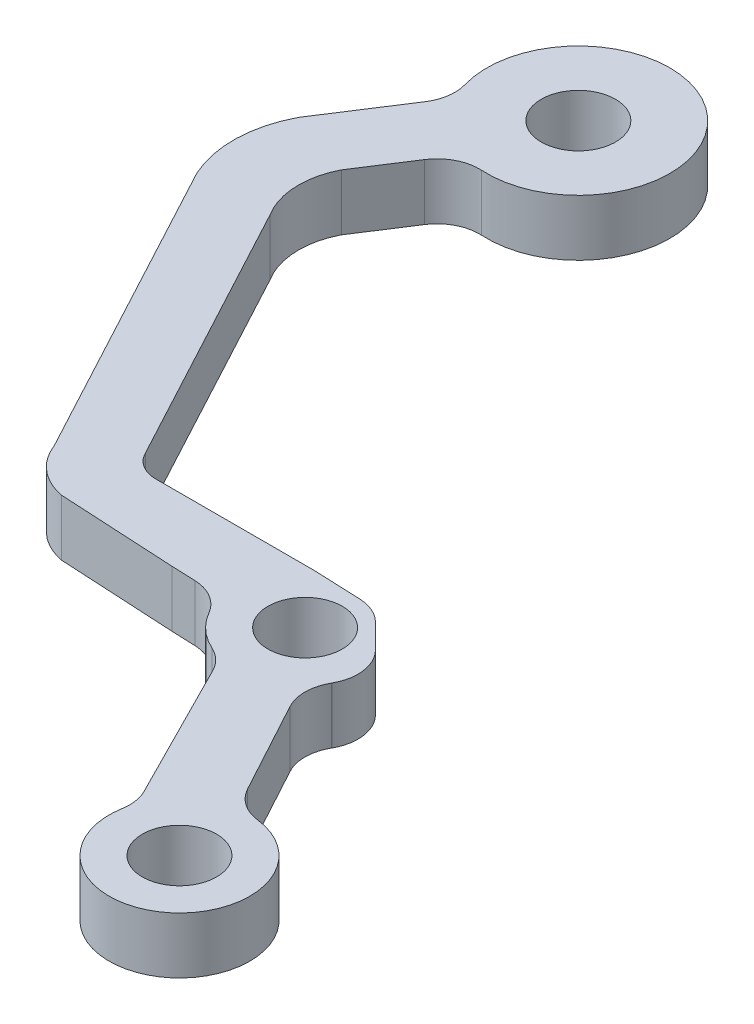
ISO-10303-21;
HEADER;
FILE_DESCRIPTION(('STEP AP214'),'2;1');
FILE_NAME('part.step','',(''),(''),'','','');
FILE_SCHEMA(('AUTOMOTIVE_DESIGN { 1 0 10303 214 1 1 1 1 }'));
ENDSEC;
DATA;
#1=APPLICATION_CONTEXT('core data for automotive mechanical design processes');
#2=APPLICATION_PROTOCOL_DEFINITION('international standard','automotive_design',2000,#1);
#3=PRODUCT_CONTEXT('',#1,'mechanical');
#4=PRODUCT('Part','Part','',(#3));
#5=PRODUCT_RELATED_PRODUCT_CATEGORY('part','',(#4));
#6=PRODUCT_DEFINITION_FORMATION('','',#4);
#7=PRODUCT_DEFINITION_CONTEXT('part definition',#1,'design');
#8=PRODUCT_DEFINITION('design','',#6,#7);
#9=PRODUCT_DEFINITION_SHAPE('','',#8);
#10=(LENGTH_UNIT() NAMED_UNIT(*) SI_UNIT(.MILLI.,.METRE.));
#11=(NAMED_UNIT(*) PLANE_ANGLE_UNIT() SI_UNIT($,.RADIAN.));
#12=(NAMED_UNIT(*) SI_UNIT($,.STERADIAN.) SOLID_ANGLE_UNIT());
#13=UNCERTAINTY_MEASURE_WITH_UNIT(LENGTH_MEASURE(1.E-05),#10,'distance_accuracy_value','');
#14=(GEOMETRIC_REPRESENTATION_CONTEXT(3) GLOBAL_UNCERTAINTY_ASSIGNED_CONTEXT((#13)) GLOBAL_UNIT_ASSIGNED_CONTEXT((#10,
#11,#12)) REPRESENTATION_CONTEXT('',''));
#15=CARTESIAN_POINT('',(0.,0.,0.));
#16=DIRECTION('',(0.,0.,1.));
#17=DIRECTION('',(1.,0.,0.));
#18=AXIS2_PLACEMENT_3D('',#15,#16,#17);
#19=CARTESIAN_POINT('',(83.0596199123193,0.,-55.4804717098662));
#20=DIRECTION('',(0.,1.,0.));
#21=DIRECTION('',(0.,0.,1.));
#22=AXIS2_PLACEMENT_3D('',#19,#20,#21);
#23=CYLINDRICAL_SURFACE('',#22,3.);
#24=CARTESIAN_POINT('',(83.0596199123193,4.,-55.4804717098662));
#25=DIRECTION('',(0.,-1.,0.));
#26=DIRECTION('',(0.,0.,-1.));
#27=AXIS2_PLACEMENT_3D('',#24,#25,#26);
#28=CIRCLE('',#27,3.);
#29=CARTESIAN_POINT('',(82.6980945632711,4.,-52.5023348053577));
#30=VERTEX_POINT('',#29);
#31=CARTESIAN_POINT('',(80.4223428568789,4.,-54.050517258547));
#32=VERTEX_POINT('',#31);
#33=EDGE_CURVE('E249',#30,#32,#28,.T.);
#34=ORIENTED_EDGE('',*,*,#33,.F.);
#35=DIRECTION('',(0.,1.,0.));
#36=VECTOR('',#35,1.);
#37=CARTESIAN_POINT('',(82.6980945632711,0.,-52.5023348053577));
#38=LINE('',#37,#36);
#39=CARTESIAN_POINT('',(82.6980945632711,0.,-52.5023348053577));
#40=VERTEX_POINT('',#39);
#41=EDGE_CURVE('E11',#40,#30,#38,.T.);
#42=ORIENTED_EDGE('',*,*,#41,.F.);
#43=CARTESIAN_POINT('',(83.0596199123193,0.,-55.4804717098662));
#44=DIRECTION('',(0.,-1.,0.));
#45=DIRECTION('',(0.,0.,-1.));
#46=AXIS2_PLACEMENT_3D('',#43,#44,#45);
#47=CIRCLE('',#46,3.);
#48=CARTESIAN_POINT('',(80.4223428568789,0.,-54.050517258547));
#49=VERTEX_POINT('',#48);
#50=EDGE_CURVE('E330',#40,#49,#47,.T.);
#51=ORIENTED_EDGE('',*,*,#50,.T.);
#52=DIRECTION('',(0.,1.,0.));
#53=VECTOR('',#52,1.);
#54=CARTESIAN_POINT('',(80.4223428568789,0.,-54.050517258547));
#55=LINE('',#54,#53);
#56=EDGE_CURVE('E35',#49,#32,#55,.T.);
#57=ORIENTED_EDGE('',*,*,#56,.T.);
#58=EDGE_LOOP('',(#34,#42,#51,#57));
#59=FACE_BOUND('',#58,.T.);
#60=ADVANCED_FACE('F32',(#59),#23,.F.);
#61=CARTESIAN_POINT('',(82.0955523148575,0.,-47.5387732978442));
#62=DIRECTION('',(0.,1.,0.));
#63=DIRECTION('',(0.,0.,1.));
#64=AXIS2_PLACEMENT_3D('',#61,#62,#63);
#65=CYLINDRICAL_SURFACE('',#64,4.99999999999926);
#66=CARTESIAN_POINT('',(82.0955523148575,4.,-47.5387732978442));
#67=DIRECTION('',(0.,1.,0.));
#68=DIRECTION('',(0.,0.,1.));
#69=AXIS2_PLACEMENT_3D('',#66,#67,#68);
#70=CIRCLE('',#69,4.99999999999926);
#71=CARTESIAN_POINT('',(77.1665825885927,4.,-48.3785693668741));
#72=VERTEX_POINT('',#71);
#73=EDGE_CURVE('E328',#72,#30,#70,.T.);
#74=ORIENTED_EDGE('',*,*,#73,.F.);
#75=DIRECTION('',(0.,1.,0.));
#76=VECTOR('',#75,1.);
#77=CARTESIAN_POINT('',(77.1665825885927,0.,-48.3785693668741));
#78=LINE('',#77,#76);
#79=CARTESIAN_POINT('',(77.1665825885927,0.,-48.3785693668741));
#80=VERTEX_POINT('',#79);
#81=EDGE_CURVE('E41',#80,#72,#78,.T.);
#82=ORIENTED_EDGE('',*,*,#81,.F.);
#83=CARTESIAN_POINT('',(82.0955523148575,0.,-47.5387732978442));
#84=DIRECTION('',(0.,1.,0.));
#85=DIRECTION('',(0.,0.,1.));
#86=AXIS2_PLACEMENT_3D('',#83,#84,#85);
#87=CIRCLE('',#86,4.99999999999926);
#88=EDGE_CURVE('E239',#80,#40,#87,.T.);
#89=ORIENTED_EDGE('',*,*,#88,.T.);
#90=ORIENTED_EDGE('',*,*,#41,.T.);
#91=EDGE_LOOP('',(#74,#82,#89,#90));
#92=FACE_BOUND('',#91,.T.);
#93=ADVANCED_FACE('F382',(#92),#65,.T.);
#94=CARTESIAN_POINT('',(74.2092007528334,0.,-48.8824470082921));
#95=DIRECTION('',(0.,1.,0.));
#96=DIRECTION('',(0.,0.,1.));
#97=AXIS2_PLACEMENT_3D('',#94,#95,#96);
#98=CYLINDRICAL_SURFACE('',#97,3.00000000000001);
#99=CARTESIAN_POINT('',(74.2092007528334,4.,-48.8824470082921));
#100=DIRECTION('',(0.,-1.,0.));
#101=DIRECTION('',(0.,0.,-1.));
#102=AXIS2_PLACEMENT_3D('',#99,#100,#101);
#103=CIRCLE('',#102,3.00000000000001);
#104=CARTESIAN_POINT('',(76.8865721846623,4.,-50.2358435562508));
#105=VERTEX_POINT('',#104);
#106=EDGE_CURVE('E226',#105,#72,#103,.T.);
#107=ORIENTED_EDGE('',*,*,#106,.F.);
#108=DIRECTION('',(0.,1.,0.));
#109=VECTOR('',#108,1.);
#110=CARTESIAN_POINT('',(76.8865721846623,0.,-50.2358435562508));
#111=LINE('',#110,#109);
#112=CARTESIAN_POINT('',(76.8865721846623,0.,-50.2358435562508));
#113=VERTEX_POINT('',#112);
#114=EDGE_CURVE('E221',#113,#105,#111,.T.);
#115=ORIENTED_EDGE('',*,*,#114,.F.);
#116=CARTESIAN_POINT('',(74.2092007528334,0.,-48.8824470082921));
#117=DIRECTION('',(0.,-1.,0.));
#118=DIRECTION('',(0.,0.,-1.));
#119=AXIS2_PLACEMENT_3D('',#116,#117,#118);
#120=CIRCLE('',#119,3.00000000000001);
#121=EDGE_CURVE('E224',#113,#80,#120,.T.);
#122=ORIENTED_EDGE('',*,*,#121,.T.);
#123=ORIENTED_EDGE('',*,*,#81,.T.);
#124=EDGE_LOOP('',(#107,#115,#122,#123));
#125=FACE_BOUND('',#124,.T.);
#126=ADVANCED_FACE('F223',(#125),#98,.F.);
#127=CARTESIAN_POINT('',(71.904734594805,0.,-60.0912179187853));
#128=DIRECTION('',(-0.892457143942962,0.,0.451132182652903));
#129=DIRECTION('',(0.451132182652903,0.,0.892457143942962));
#130=AXIS2_PLACEMENT_3D('',#127,#128,#129);
#131=PLANE('',#130);
#132=DIRECTION('',(0.451132182652903,0.,0.892457143942962));
#133=VECTOR('',#132,1.);
#134=CARTESIAN_POINT('',(71.904734594805,4.,-60.0912179187853));
#135=LINE('',#134,#133);
#136=CARTESIAN_POINT('',(71.904734594805,4.,-60.0912179187853));
#137=VERTEX_POINT('',#136);
#138=EDGE_CURVE('E325',#137,#105,#135,.T.);
#139=ORIENTED_EDGE('',*,*,#138,.F.);
#140=DIRECTION('',(0.,1.,0.));
#141=VECTOR('',#140,1.);
#142=CARTESIAN_POINT('',(71.904734594805,0.,-60.0912179187853));
#143=LINE('',#142,#141);
#144=CARTESIAN_POINT('',(71.904734594805,0.,-60.0912179187853));
#145=VERTEX_POINT('',#144);
#146=EDGE_CURVE('E231',#145,#137,#143,.T.);
#147=ORIENTED_EDGE('',*,*,#146,.F.);
#148=DIRECTION('',(0.451132182652903,0.,0.892457143942962));
#149=VECTOR('',#148,1.);
#150=CARTESIAN_POINT('',(71.904734594805,0.,-60.0912179187853));
#151=LINE('',#150,#149);
#152=EDGE_CURVE('E237',#145,#113,#151,.T.);
#153=ORIENTED_EDGE('',*,*,#152,.T.);
#154=ORIENTED_EDGE('',*,*,#114,.T.);
#155=EDGE_LOOP('',(#139,#147,#153,#154));
#156=FACE_BOUND('',#155,.T.);
#157=ADVANCED_FACE('F241',(#156),#131,.T.);
#158=CARTESIAN_POINT('',(69.2273631629761,0.,-58.7378213708266));
#159=DIRECTION('',(0.,1.,0.));
#160=DIRECTION('',(0.,0.,1.));
#161=AXIS2_PLACEMENT_3D('',#158,#159,#160);
#162=CYLINDRICAL_SURFACE('',#161,3.00000000000002);
#163=CARTESIAN_POINT('',(69.2273631629761,4.,-58.7378213708266));
#164=DIRECTION('',(0.,-1.,0.));
#165=DIRECTION('',(0.,0.,-1.));
#166=AXIS2_PLACEMENT_3D('',#163,#164,#165);
#167=CIRCLE('',#166,3.00000000000002);
#168=CARTESIAN_POINT('',(70.4690978001735,4.,-61.4687726869039));
#169=VERTEX_POINT('',#168);
#170=EDGE_CURVE('E322',#169,#137,#167,.T.);
#171=ORIENTED_EDGE('',*,*,#170,.F.);
#172=DIRECTION('',(0.,1.,0.));
#173=VECTOR('',#172,1.);
#174=CARTESIAN_POINT('',(70.4690978001735,0.,-61.4687726869039));
#175=LINE('',#174,#173);
#176=CARTESIAN_POINT('',(70.4690978001735,0.,-61.4687726869039));
#177=VERTEX_POINT('',#176);
#178=EDGE_CURVE('E334',#177,#169,#175,.T.);
#179=ORIENTED_EDGE('',*,*,#178,.F.);
#180=CARTESIAN_POINT('',(69.2273631629761,0.,-58.7378213708266));
#181=DIRECTION('',(0.,-1.,0.));
#182=DIRECTION('',(0.,0.,-1.));
#183=AXIS2_PLACEMENT_3D('',#180,#181,#182);
#184=CIRCLE('',#183,3.00000000000002);
#185=EDGE_CURVE('E242',#177,#145,#184,.T.);
#186=ORIENTED_EDGE('',*,*,#185,.T.);
#187=ORIENTED_EDGE('',*,*,#146,.T.);
#188=EDGE_LOOP('',(#171,#179,#186,#187));
#189=FACE_BOUND('',#188,.T.);
#190=ADVANCED_FACE('F395',(#189),#162,.F.);
#191=CARTESIAN_POINT('',(72.5386555288353,0.,-66.0203582136984));
#192=DIRECTION('',(0.,1.,0.));
#193=DIRECTION('',(0.,0.,1.));
#194=AXIS2_PLACEMENT_3D('',#191,#192,#193);
#195=CYLINDRICAL_SURFACE('',#194,4.99999999999894);
#196=CARTESIAN_POINT('',(72.5386555288353,4.,-66.0203582136984));
#197=DIRECTION('',(0.,1.,0.));
#198=DIRECTION('',(0.,0.,1.));
#199=AXIS2_PLACEMENT_3D('',#196,#197,#198);
#200=CIRCLE('',#199,4.99999999999894);
#201=CARTESIAN_POINT('',(68.2142097116327,4.,-63.5105438034147));
#202=VERTEX_POINT('',#201);
#203=EDGE_CURVE('E319',#202,#169,#200,.T.);
#204=ORIENTED_EDGE('',*,*,#203,.F.);
#205=DIRECTION('',(0.,1.,0.));
#206=VECTOR('',#205,1.);
#207=CARTESIAN_POINT('',(68.2142097116327,0.,-63.5105438034147));
#208=LINE('',#207,#206);
#209=CARTESIAN_POINT('',(68.2142097116327,0.,-63.5105438034147));
#210=VERTEX_POINT('',#209);
#211=EDGE_CURVE('E336',#210,#202,#208,.T.);
#212=ORIENTED_EDGE('',*,*,#211,.F.);
#213=CARTESIAN_POINT('',(72.5386555288353,0.,-66.0203582136984));
#214=DIRECTION('',(0.,1.,0.));
#215=DIRECTION('',(0.,0.,1.));
#216=AXIS2_PLACEMENT_3D('',#213,#214,#215);
#217=CIRCLE('',#216,4.99999999999894);
#218=EDGE_CURVE('E244',#210,#177,#217,.T.);
#219=ORIENTED_EDGE('',*,*,#218,.T.);
#220=ORIENTED_EDGE('',*,*,#178,.T.);
#221=EDGE_LOOP('',(#204,#212,#219,#220));
#222=FACE_BOUND('',#221,.T.);
#223=ADVANCED_FACE('F398',(#222),#195,.T.);
#224=CARTESIAN_POINT('',(65.6195422213106,0.,-62.0046551572441));
#225=DIRECTION('',(0.,1.,0.));
#226=DIRECTION('',(0.,0.,1.));
#227=AXIS2_PLACEMENT_3D('',#224,#225,#226);
#228=CYLINDRICAL_SURFACE('',#227,3.);
#229=CARTESIAN_POINT('',(65.6195422213106,4.,-62.0046551572441));
#230=DIRECTION('',(0.,-1.,0.));
#231=DIRECTION('',(0.,0.,-1.));
#232=AXIS2_PLACEMENT_3D('',#229,#230,#231);
#233=CIRCLE('',#232,3.);
#234=CARTESIAN_POINT('',(65.7370015210181,4.,-65.0023548274766));
#235=VERTEX_POINT('',#234);
#236=EDGE_CURVE('E316',#235,#202,#233,.T.);
#237=ORIENTED_EDGE('',*,*,#236,.F.);
#238=DIRECTION('',(0.,1.,0.));
#239=VECTOR('',#238,1.);
#240=CARTESIAN_POINT('',(65.7370015210181,0.,-65.0023548274766));
#241=LINE('',#240,#239);
#242=CARTESIAN_POINT('',(65.7370015210181,0.,-65.0023548274766));
#243=VERTEX_POINT('',#242);
#244=EDGE_CURVE('E338',#243,#235,#241,.T.);
#245=ORIENTED_EDGE('',*,*,#244,.F.);
#246=CARTESIAN_POINT('',(65.6195422213106,0.,-62.0046551572441));
#247=DIRECTION('',(0.,-1.,0.));
#248=DIRECTION('',(0.,0.,-1.));
#249=AXIS2_PLACEMENT_3D('',#246,#247,#248);
#250=CIRCLE('',#249,3.);
#251=EDGE_CURVE('E594',#243,#210,#250,.T.);
#252=ORIENTED_EDGE('',*,*,#251,.T.);
#253=ORIENTED_EDGE('',*,*,#211,.T.);
#254=EDGE_LOOP('',(#237,#245,#252,#253));
#255=FACE_BOUND('',#254,.T.);
#256=ADVANCED_FACE('F402',(#255),#228,.F.);
#257=CARTESIAN_POINT('',(64.0438520876017,0.,-65.0686977465904));
#258=DIRECTION('',(-0.0391530999025642,0.,0.999233223410841));
#259=DIRECTION('',(0.999233223410841,0.,0.0391530999025642));
#260=AXIS2_PLACEMENT_3D('',#257,#258,#259);
#261=PLANE('',#260);
#262=DIRECTION('',(0.999233223410841,0.,0.0391530999025642));
#263=VECTOR('',#262,1.);
#264=CARTESIAN_POINT('',(64.0438520876017,4.,-65.0686977465904));
#265=LINE('',#264,#263);
#266=CARTESIAN_POINT('',(64.0438520876017,4.,-65.0686977465904));
#267=VERTEX_POINT('',#266);
#268=EDGE_CURVE('E313',#267,#235,#265,.T.);
#269=ORIENTED_EDGE('',*,*,#268,.F.);
#270=DIRECTION('',(0.,1.,0.));
#271=VECTOR('',#270,1.);
#272=CARTESIAN_POINT('',(64.0438520876017,0.,-65.0686977465904));
#273=LINE('',#272,#271);
#274=CARTESIAN_POINT('',(64.0438520876017,0.,-65.0686977465904));
#275=VERTEX_POINT('',#274);
#276=EDGE_CURVE('E340',#275,#267,#273,.T.);
#277=ORIENTED_EDGE('',*,*,#276,.F.);
#278=DIRECTION('',(0.999233223410841,0.,0.0391530999025642));
#279=VECTOR('',#278,1.);
#280=CARTESIAN_POINT('',(64.0438520876017,0.,-65.0686977465904));
#281=LINE('',#280,#279);
#282=EDGE_CURVE('E591',#275,#243,#281,.T.);
#283=ORIENTED_EDGE('',*,*,#282,.T.);
#284=ORIENTED_EDGE('',*,*,#244,.T.);
#285=EDGE_LOOP('',(#269,#277,#283,#284));
#286=FACE_BOUND('',#285,.T.);
#287=ADVANCED_FACE('F406',(#286),#261,.T.);
#288=CARTESIAN_POINT('',(55.7375550039908,0.,-65.5195460971233));
#289=DIRECTION('',(-0.054198120998577,0.,0.998530201686571));
#290=DIRECTION('',(0.998530201686571,0.,0.054198120998577));
#291=AXIS2_PLACEMENT_3D('',#288,#289,#290);
#292=PLANE('',#291);
#293=DIRECTION('',(0.998530201686571,0.,0.054198120998577));
#294=VECTOR('',#293,1.);
#295=CARTESIAN_POINT('',(55.7375550039908,4.,-65.5195460971233));
#296=LINE('',#295,#294);
#297=CARTESIAN_POINT('',(55.7375550039908,4.,-65.5195460971233));
#298=VERTEX_POINT('',#297);
#299=EDGE_CURVE('E310',#298,#267,#296,.T.);
#300=ORIENTED_EDGE('',*,*,#299,.F.);
#301=DIRECTION('',(0.,1.,0.));
#302=VECTOR('',#301,1.);
#303=CARTESIAN_POINT('',(55.7375550039908,0.,-65.5195460971233));
#304=LINE('',#303,#302);
#305=CARTESIAN_POINT('',(55.7375550039908,0.,-65.5195460971233));
#306=VERTEX_POINT('',#305);
#307=EDGE_CURVE('E342',#306,#298,#304,.T.);
#308=ORIENTED_EDGE('',*,*,#307,.F.);
#309=DIRECTION('',(0.998530201686571,0.,0.054198120998577));
#310=VECTOR('',#309,1.);
#311=CARTESIAN_POINT('',(55.7375550039908,0.,-65.5195460971233));
#312=LINE('',#311,#310);
#313=EDGE_CURVE('E588',#306,#275,#312,.T.);
#314=ORIENTED_EDGE('',*,*,#313,.T.);
#315=ORIENTED_EDGE('',*,*,#276,.T.);
#316=EDGE_LOOP('',(#300,#308,#314,#315));
#317=FACE_BOUND('',#316,.T.);
#318=ADVANCED_FACE('F410',(#317),#292,.T.);
#319=CARTESIAN_POINT('',(56.5567534131058,0.,-69.8369992339137));
#320=DIRECTION('',(0.,1.,0.));
#321=DIRECTION('',(0.,0.,1.));
#322=AXIS2_PLACEMENT_3D('',#319,#320,#321);
#323=CYLINDRICAL_SURFACE('',#322,4.39448377194385);
#324=CARTESIAN_POINT('',(56.5567534131058,4.,-69.8369992339137));
#325=DIRECTION('',(0.,1.,0.));
#326=DIRECTION('',(0.,0.,1.));
#327=AXIS2_PLACEMENT_3D('',#324,#325,#326);
#328=CIRCLE('',#327,4.39448377194385);
#329=CARTESIAN_POINT('',(52.4487514228716,4.,-68.2762919358881));
#330=VERTEX_POINT('',#329);
#331=EDGE_CURVE('E307',#330,#298,#328,.T.);
#332=ORIENTED_EDGE('',*,*,#331,.F.);
#333=DIRECTION('',(0.,1.,0.));
#334=VECTOR('',#333,1.);
#335=CARTESIAN_POINT('',(52.4487514228716,0.,-68.2762919358881));
#336=LINE('',#335,#334);
#337=CARTESIAN_POINT('',(52.4487514228716,0.,-68.2762919358881));
#338=VERTEX_POINT('',#337);
#339=EDGE_CURVE('E344',#338,#330,#336,.T.);
#340=ORIENTED_EDGE('',*,*,#339,.F.);
#341=CARTESIAN_POINT('',(56.5567534131058,0.,-69.8369992339137));
#342=DIRECTION('',(0.,1.,0.));
#343=DIRECTION('',(0.,0.,1.));
#344=AXIS2_PLACEMENT_3D('',#341,#342,#343);
#345=CIRCLE('',#344,4.39448377194385);
#346=EDGE_CURVE('E585',#338,#306,#345,.T.);
#347=ORIENTED_EDGE('',*,*,#346,.T.);
#348=ORIENTED_EDGE('',*,*,#307,.T.);
#349=EDGE_LOOP('',(#332,#340,#347,#348));
#350=FACE_BOUND('',#349,.T.);
#351=ADVANCED_FACE('F414',(#350),#323,.T.);
#352=CARTESIAN_POINT('',(40.729811239487,0.,-90.1399863078729));
#353=DIRECTION('',(-0.881375126691502,0.,0.472417067906675));
#354=DIRECTION('',(0.472417067906675,0.,0.881375126691502));
#355=AXIS2_PLACEMENT_3D('',#352,#353,#354);
#356=PLANE('',#355);
#357=DIRECTION('',(0.472417067906675,0.,0.881375126691502));
#358=VECTOR('',#357,1.);
#359=CARTESIAN_POINT('',(40.729811239487,4.,-90.1399863078729));
#360=LINE('',#359,#358);
#361=CARTESIAN_POINT('',(40.729811239487,4.,-90.1399863078729));
#362=VERTEX_POINT('',#361);
#363=EDGE_CURVE('E304',#362,#330,#360,.T.);
#364=ORIENTED_EDGE('',*,*,#363,.F.);
#365=DIRECTION('',(0.,1.,0.));
#366=VECTOR('',#365,1.);
#367=CARTESIAN_POINT('',(40.729811239487,0.,-90.1399863078729));
#368=LINE('',#367,#366);
#369=CARTESIAN_POINT('',(40.729811239487,0.,-90.1399863078729));
#370=VERTEX_POINT('',#369);
#371=EDGE_CURVE('E346',#370,#362,#368,.T.);
#372=ORIENTED_EDGE('',*,*,#371,.F.);
#373=DIRECTION('',(0.472417067906675,0.,0.881375126691502));
#374=VECTOR('',#373,1.);
#375=CARTESIAN_POINT('',(40.729811239487,0.,-90.1399863078729));
#376=LINE('',#375,#374);
#377=EDGE_CURVE('E582',#370,#338,#376,.T.);
#378=ORIENTED_EDGE('',*,*,#377,.T.);
#379=ORIENTED_EDGE('',*,*,#339,.T.);
#380=EDGE_LOOP('',(#364,#372,#378,#379));
#381=FACE_BOUND('',#380,.T.);
#382=ADVANCED_FACE('F418',(#381),#356,.T.);
#383=CARTESIAN_POINT('',(47.9507836864078,0.,-93.4720928434898));
#384=DIRECTION('',(0.,1.,0.));
#385=DIRECTION('',(0.,0.,1.));
#386=AXIS2_PLACEMENT_3D('',#383,#384,#385);
#387=CYLINDRICAL_SURFACE('',#386,7.95269621222196);
#388=CARTESIAN_POINT('',(47.9507836864078,4.,-93.4720928434898));
#389=DIRECTION('',(0.,1.,0.));
#390=DIRECTION('',(0.,0.,1.));
#391=AXIS2_PLACEMENT_3D('',#388,#389,#390);
#392=CIRCLE('',#391,7.95269621222196);
#393=CARTESIAN_POINT('',(40.9176822364304,4.,-97.1843510562513));
#394=VERTEX_POINT('',#393);
#395=EDGE_CURVE('E301',#394,#362,#392,.T.);
#396=ORIENTED_EDGE('',*,*,#395,.F.);
#397=DIRECTION('',(0.,1.,0.));
#398=VECTOR('',#397,1.);
#399=CARTESIAN_POINT('',(40.9176822364304,0.,-97.1843510562513));
#400=LINE('',#399,#398);
#401=CARTESIAN_POINT('',(40.9176822364304,0.,-97.1843510562513));
#402=VERTEX_POINT('',#401);
#403=EDGE_CURVE('E348',#402,#394,#400,.T.);
#404=ORIENTED_EDGE('',*,*,#403,.F.);
#405=CARTESIAN_POINT('',(47.9507836864078,0.,-93.4720928434898));
#406=DIRECTION('',(0.,1.,0.));
#407=DIRECTION('',(0.,0.,1.));
#408=AXIS2_PLACEMENT_3D('',#405,#406,#407);
#409=CIRCLE('',#408,7.95269621222196);
#410=EDGE_CURVE('E579',#402,#370,#409,.T.);
#411=ORIENTED_EDGE('',*,*,#410,.T.);
#412=ORIENTED_EDGE('',*,*,#371,.T.);
#413=EDGE_LOOP('',(#396,#404,#411,#412));
#414=FACE_BOUND('',#413,.T.);
#415=ADVANCED_FACE('F422',(#414),#387,.T.);
#416=CARTESIAN_POINT('',(44.4477571247904,0.,-102.646677462451));
#417=DIRECTION('',(-0.839876598626589,0.,-0.542777393670215));
#418=DIRECTION('',(-0.542777393670215,0.,0.839876598626589));
#419=AXIS2_PLACEMENT_3D('',#416,#417,#418);
#420=PLANE('',#419);
#421=DIRECTION('',(-0.542777393670215,0.,0.839876598626589));
#422=VECTOR('',#421,1.);
#423=CARTESIAN_POINT('',(44.4477571247904,4.,-102.646677462451));
#424=LINE('',#423,#422);
#425=CARTESIAN_POINT('',(44.4477571247904,4.,-102.646677462451));
#426=VERTEX_POINT('',#425);
#427=EDGE_CURVE('E298',#426,#394,#424,.T.);
#428=ORIENTED_EDGE('',*,*,#427,.F.);
#429=DIRECTION('',(0.,1.,0.));
#430=VECTOR('',#429,1.);
#431=CARTESIAN_POINT('',(44.4477571247904,0.,-102.646677462451));
#432=LINE('',#431,#430);
#433=CARTESIAN_POINT('',(44.4477571247904,0.,-102.646677462451));
#434=VERTEX_POINT('',#433);
#435=EDGE_CURVE('E350',#434,#426,#432,.T.);
#436=ORIENTED_EDGE('',*,*,#435,.F.);
#437=DIRECTION('',(-0.542777393670215,0.,0.839876598626589));
#438=VECTOR('',#437,1.);
#439=CARTESIAN_POINT('',(44.4477571247904,0.,-102.646677462451));
#440=LINE('',#439,#438);
#441=EDGE_CURVE('E576',#434,#402,#440,.T.);
#442=ORIENTED_EDGE('',*,*,#441,.T.);
#443=ORIENTED_EDGE('',*,*,#403,.T.);
#444=EDGE_LOOP('',(#428,#436,#442,#443));
#445=FACE_BOUND('',#444,.T.);
#446=ADVANCED_FACE('F426',(#445),#420,.T.);
#447=CARTESIAN_POINT('',(41.9281273289106,0.,-104.275009643461));
#448=DIRECTION('',(0.,1.,0.));
#449=DIRECTION('',(0.,0.,1.));
#450=AXIS2_PLACEMENT_3D('',#447,#448,#449);
#451=CYLINDRICAL_SURFACE('',#450,3.);
#452=CARTESIAN_POINT('',(41.9281273289106,4.,-104.275009643461));
#453=DIRECTION('',(0.,-1.,0.));
#454=DIRECTION('',(0.,0.,-1.));
#455=AXIS2_PLACEMENT_3D('',#452,#453,#454);
#456=CIRCLE('',#455,3.);
#457=CARTESIAN_POINT('',(44.8098479908705,4.,-105.109087593316));
#458=VERTEX_POINT('',#457);
#459=EDGE_CURVE('E295',#458,#426,#456,.T.);
#460=ORIENTED_EDGE('',*,*,#459,.F.);
#461=DIRECTION('',(0.,1.,0.));
#462=VECTOR('',#461,1.);
#463=CARTESIAN_POINT('',(44.8098479908705,0.,-105.109087593316));
#464=LINE('',#463,#462);
#465=CARTESIAN_POINT('',(44.8098479908705,0.,-105.109087593316));
#466=VERTEX_POINT('',#465);
#467=EDGE_CURVE('E352',#466,#458,#464,.T.);
#468=ORIENTED_EDGE('',*,*,#467,.F.);
#469=CARTESIAN_POINT('',(41.9281273289106,0.,-104.275009643461));
#470=DIRECTION('',(0.,-1.,0.));
#471=DIRECTION('',(0.,0.,-1.));
#472=AXIS2_PLACEMENT_3D('',#469,#470,#471);
#473=CIRCLE('',#472,3.);
#474=EDGE_CURVE('E573',#466,#434,#473,.T.);
#475=ORIENTED_EDGE('',*,*,#474,.T.);
#476=ORIENTED_EDGE('',*,*,#435,.T.);
#477=EDGE_LOOP('',(#460,#468,#475,#476));
#478=FACE_BOUND('',#477,.T.);
#479=ADVANCED_FACE('F430',(#478),#451,.F.);
#480=CARTESIAN_POINT('',(51.0535760917837,0.,-106.916256484667));
#481=DIRECTION('',(0.,1.,0.));
#482=DIRECTION('',(0.,0.,1.));
#483=AXIS2_PLACEMENT_3D('',#480,#481,#482);
#484=CYLINDRICAL_SURFACE('',#483,6.50000000000002);
#485=CARTESIAN_POINT('',(51.0535760917837,4.,-106.916256484667));
#486=DIRECTION('',(0.,1.,0.));
#487=DIRECTION('',(0.,0.,1.));
#488=AXIS2_PLACEMENT_3D('',#485,#486,#487);
#489=CIRCLE('',#488,6.50000000000002);
#490=CARTESIAN_POINT('',(50.6775616564036,4.,-100.427141510775));
#491=VERTEX_POINT('',#490);
#492=EDGE_CURVE('E292',#491,#458,#489,.T.);
#493=ORIENTED_EDGE('',*,*,#492,.F.);
#494=DIRECTION('',(0.,1.,0.));
#495=VECTOR('',#494,1.);
#496=CARTESIAN_POINT('',(50.6775616564036,0.,-100.427141510775));
#497=LINE('',#496,#495);
#498=CARTESIAN_POINT('',(50.6775616564036,0.,-100.427141510775));
#499=VERTEX_POINT('',#498);
#500=EDGE_CURVE('E354',#499,#491,#497,.T.);
#501=ORIENTED_EDGE('',*,*,#500,.F.);
#502=CARTESIAN_POINT('',(51.0535760917837,0.,-106.916256484667));
#503=DIRECTION('',(0.,1.,0.));
#504=DIRECTION('',(0.,0.,1.));
#505=AXIS2_PLACEMENT_3D('',#502,#503,#504);
#506=CIRCLE('',#505,6.50000000000002);
#507=EDGE_CURVE('E570',#499,#466,#506,.T.);
#508=ORIENTED_EDGE('',*,*,#507,.T.);
#509=ORIENTED_EDGE('',*,*,#467,.T.);
#510=EDGE_LOOP('',(#493,#501,#508,#509));
#511=FACE_BOUND('',#510,.T.);
#512=ADVANCED_FACE('F434',(#511),#484,.T.);
#513=CARTESIAN_POINT('',(50.504016532382,0.,-97.4321653689791));
#514=DIRECTION('',(0.,1.,0.));
#515=DIRECTION('',(0.,0.,1.));
#516=AXIS2_PLACEMENT_3D('',#513,#514,#515);
#517=CYLINDRICAL_SURFACE('',#516,3.);
#518=CARTESIAN_POINT('',(50.504016532382,4.,-97.4321653689791));
#519=DIRECTION('',(0.,-1.,0.));
#520=DIRECTION('',(0.,0.,-1.));
#521=AXIS2_PLACEMENT_3D('',#518,#519,#520);
#522=CIRCLE('',#521,3.);
#523=CARTESIAN_POINT('',(47.9843867365023,4.,-99.0604975499897));
#524=VERTEX_POINT('',#523);
#525=EDGE_CURVE('E289',#524,#491,#522,.T.);
#526=ORIENTED_EDGE('',*,*,#525,.F.);
#527=DIRECTION('',(0.,1.,0.));
#528=VECTOR('',#527,1.);
#529=CARTESIAN_POINT('',(47.9843867365023,0.,-99.0604975499897));
#530=LINE('',#529,#528);
#531=CARTESIAN_POINT('',(47.9843867365023,0.,-99.0604975499897));
#532=VERTEX_POINT('',#531);
#533=EDGE_CURVE('E356',#532,#524,#530,.T.);
#534=ORIENTED_EDGE('',*,*,#533,.F.);
#535=CARTESIAN_POINT('',(50.504016532382,0.,-97.4321653689791));
#536=DIRECTION('',(0.,-1.,0.));
#537=DIRECTION('',(0.,0.,-1.));
#538=AXIS2_PLACEMENT_3D('',#535,#536,#537);
#539=CIRCLE('',#538,3.);
#540=EDGE_CURVE('E567',#532,#499,#539,.T.);
#541=ORIENTED_EDGE('',*,*,#540,.T.);
#542=ORIENTED_EDGE('',*,*,#500,.T.);
#543=EDGE_LOOP('',(#526,#534,#541,#542));
#544=FACE_BOUND('',#543,.T.);
#545=ADVANCED_FACE('F438',(#544),#517,.F.);
#546=CARTESIAN_POINT('',(45.6619983025613,0.,-95.4669070258914));
#547=DIRECTION('',(0.839876598626591,0.,0.542777393670212));
#548=DIRECTION('',(0.542777393670212,0.,-0.839876598626591));
#549=AXIS2_PLACEMENT_3D('',#546,#547,#548);
#550=PLANE('',#549);
#551=DIRECTION('',(0.542777393670212,0.,-0.839876598626591));
#552=VECTOR('',#551,1.);
#553=CARTESIAN_POINT('',(45.6619983025613,4.,-95.4669070258914));
#554=LINE('',#553,#552);
#555=CARTESIAN_POINT('',(45.6619983025613,4.,-95.4669070258914));
#556=VERTEX_POINT('',#555);
#557=EDGE_CURVE('E286',#556,#524,#554,.T.);
#558=ORIENTED_EDGE('',*,*,#557,.F.);
#559=DIRECTION('',(0.,1.,0.));
#560=VECTOR('',#559,1.);
#561=CARTESIAN_POINT('',(45.6619983025613,0.,-95.4669070258914));
#562=LINE('',#561,#560);
#563=CARTESIAN_POINT('',(45.6619983025613,0.,-95.4669070258914));
#564=VERTEX_POINT('',#563);
#565=EDGE_CURVE('E358',#564,#556,#562,.T.);
#566=ORIENTED_EDGE('',*,*,#565,.F.);
#567=DIRECTION('',(0.542777393670212,0.,-0.839876598626591));
#568=VECTOR('',#567,1.);
#569=CARTESIAN_POINT('',(45.6619983025613,0.,-95.4669070258914));
#570=LINE('',#569,#568);
#571=EDGE_CURVE('E564',#564,#532,#570,.T.);
#572=ORIENTED_EDGE('',*,*,#571,.T.);
#573=ORIENTED_EDGE('',*,*,#533,.T.);
#574=EDGE_LOOP('',(#558,#566,#572,#573));
#575=FACE_BOUND('',#574,.T.);
#576=ADVANCED_FACE('F442',(#575),#550,.T.);
#577=CARTESIAN_POINT('',(50.4346230187118,0.,-93.0228199018659));
#578=DIRECTION('',(0.,1.,0.));
#579=DIRECTION('',(0.,0.,1.));
#580=AXIS2_PLACEMENT_3D('',#577,#578,#579);
#581=CYLINDRICAL_SURFACE('',#580,5.36204331864607);
#582=CARTESIAN_POINT('',(50.4346230187118,4.,-93.0228199018659));
#583=DIRECTION('',(0.,-1.,0.));
#584=DIRECTION('',(0.,0.,-1.));
#585=AXIS2_PLACEMENT_3D('',#582,#583,#584);
#586=CIRCLE('',#585,5.36204331864607);
#587=CARTESIAN_POINT('',(45.9134750427678,4.,-90.1399863078728));
#588=VERTEX_POINT('',#587);
#589=EDGE_CURVE('E283',#588,#556,#586,.T.);
#590=ORIENTED_EDGE('',*,*,#589,.F.);
#591=DIRECTION('',(0.,1.,0.));
#592=VECTOR('',#591,1.);
#593=CARTESIAN_POINT('',(45.9134750427678,0.,-90.1399863078728));
#594=LINE('',#593,#592);
#595=CARTESIAN_POINT('',(45.9134750427678,0.,-90.1399863078728));
#596=VERTEX_POINT('',#595);
#597=EDGE_CURVE('E360',#596,#588,#594,.T.);
#598=ORIENTED_EDGE('',*,*,#597,.F.);
#599=CARTESIAN_POINT('',(50.4346230187118,0.,-93.0228199018659));
#600=DIRECTION('',(0.,-1.,0.));
#601=DIRECTION('',(0.,0.,-1.));
#602=AXIS2_PLACEMENT_3D('',#599,#600,#601);
#603=CIRCLE('',#602,5.36204331864607);
#604=EDGE_CURVE('E561',#596,#564,#603,.T.);
#605=ORIENTED_EDGE('',*,*,#604,.T.);
#606=ORIENTED_EDGE('',*,*,#565,.T.);
#607=EDGE_LOOP('',(#590,#598,#605,#606));
#608=FACE_BOUND('',#607,.T.);
#609=ADVANCED_FACE('F446',(#608),#581,.F.);
#610=CARTESIAN_POINT('',(56.1159876547183,0.,-71.1054478527404));
#611=DIRECTION('',(0.881375126691525,0.,-0.472417067906631));
#612=DIRECTION('',(-0.472417067906631,0.,-0.881375126691525));
#613=AXIS2_PLACEMENT_3D('',#610,#611,#612);
#614=PLANE('',#613);
#615=DIRECTION('',(-0.472417067906631,0.,-0.881375126691525));
#616=VECTOR('',#615,1.);
#617=CARTESIAN_POINT('',(56.1159876547183,4.,-71.1054478527404));
#618=LINE('',#617,#616);
#619=CARTESIAN_POINT('',(56.1159876547183,4.,-71.1054478527404));
#620=VERTEX_POINT('',#619);
#621=EDGE_CURVE('E280',#620,#588,#618,.T.);
#622=ORIENTED_EDGE('',*,*,#621,.F.);
#623=DIRECTION('',(0.,1.,0.));
#624=VECTOR('',#623,1.);
#625=CARTESIAN_POINT('',(56.1159876547183,0.,-71.1054478527404));
#626=LINE('',#625,#624);
#627=CARTESIAN_POINT('',(56.1159876547183,0.,-71.1054478527404));
#628=VERTEX_POINT('',#627);
#629=EDGE_CURVE('E362',#628,#620,#626,.T.);
#630=ORIENTED_EDGE('',*,*,#629,.F.);
#631=DIRECTION('',(-0.472417067906631,0.,-0.881375126691525));
#632=VECTOR('',#631,1.);
#633=CARTESIAN_POINT('',(56.1159876547183,0.,-71.1054478527404));
#634=LINE('',#633,#632);
#635=EDGE_CURVE('E558',#628,#596,#634,.T.);
#636=ORIENTED_EDGE('',*,*,#635,.T.);
#637=ORIENTED_EDGE('',*,*,#597,.T.);
#638=EDGE_LOOP('',(#622,#630,#636,#637));
#639=FACE_BOUND('',#638,.T.);
#640=ADVANCED_FACE('F450',(#639),#614,.T.);
#641=CARTESIAN_POINT('',(58.0835273072173,0.,-72.0445419678826));
#642=DIRECTION('',(0.,1.,0.));
#643=DIRECTION('',(0.,0.,1.));
#644=AXIS2_PLACEMENT_3D('',#641,#642,#643);
#645=CYLINDRICAL_SURFACE('',#644,2.18016284741548);
#646=CARTESIAN_POINT('',(58.0835273072173,4.,-72.0445419678826));
#647=DIRECTION('',(0.,-1.,0.));
#648=DIRECTION('',(0.,0.,-1.));
#649=AXIS2_PLACEMENT_3D('',#646,#647,#648);
#650=CIRCLE('',#649,2.18016284741548);
#651=CARTESIAN_POINT('',(58.0479318695405,4.,-69.864669722528));
#652=VERTEX_POINT('',#651);
#653=EDGE_CURVE('E277',#652,#620,#650,.T.);
#654=ORIENTED_EDGE('',*,*,#653,.F.);
#655=DIRECTION('',(0.,1.,0.));
#656=VECTOR('',#655,1.);
#657=CARTESIAN_POINT('',(58.0479318695405,0.,-69.864669722528));
#658=LINE('',#657,#656);
#659=CARTESIAN_POINT('',(58.0479318695405,0.,-69.864669722528));
#660=VERTEX_POINT('',#659);
#661=EDGE_CURVE('E364',#660,#652,#658,.T.);
#662=ORIENTED_EDGE('',*,*,#661,.F.);
#663=CARTESIAN_POINT('',(58.0835273072173,0.,-72.0445419678826));
#664=DIRECTION('',(0.,-1.,0.));
#665=DIRECTION('',(0.,0.,-1.));
#666=AXIS2_PLACEMENT_3D('',#663,#664,#665);
#667=CIRCLE('',#666,2.18016284741548);
#668=EDGE_CURVE('E555',#660,#628,#667,.T.);
#669=ORIENTED_EDGE('',*,*,#668,.T.);
#670=ORIENTED_EDGE('',*,*,#629,.T.);
#671=EDGE_LOOP('',(#654,#662,#669,#670));
#672=FACE_BOUND('',#671,.T.);
#673=ADVANCED_FACE('F454',(#672),#645,.F.);
#674=CARTESIAN_POINT('',(69.3415835835907,0.,-69.8646697225282));
#675=DIRECTION('',(0.,0.,-1.));
#676=DIRECTION('',(-1.,0.,0.));
#677=AXIS2_PLACEMENT_3D('',#674,#675,#676);
#678=PLANE('',#677);
#679=DIRECTION('',(-1.,0.,0.));
#680=VECTOR('',#679,1.);
#681=CARTESIAN_POINT('',(69.3415835835907,4.,-69.8646697225282));
#682=LINE('',#681,#680);
#683=CARTESIAN_POINT('',(69.3415835835907,4.,-69.8646697225282));
#684=VERTEX_POINT('',#683);
#685=EDGE_CURVE('E274',#684,#652,#682,.T.);
#686=ORIENTED_EDGE('',*,*,#685,.F.);
#687=DIRECTION('',(0.,1.,0.));
#688=VECTOR('',#687,1.);
#689=CARTESIAN_POINT('',(69.3415835835907,0.,-69.8646697225282));
#690=LINE('',#689,#688);
#691=CARTESIAN_POINT('',(69.3415835835907,0.,-69.8646697225282));
#692=VERTEX_POINT('',#691);
#693=EDGE_CURVE('E366',#692,#684,#690,.T.);
#694=ORIENTED_EDGE('',*,*,#693,.F.);
#695=DIRECTION('',(-1.,0.,0.));
#696=VECTOR('',#695,1.);
#697=CARTESIAN_POINT('',(69.3415835835907,0.,-69.8646697225282));
#698=LINE('',#697,#696);
#699=EDGE_CURVE('E552',#692,#660,#698,.T.);
#700=ORIENTED_EDGE('',*,*,#699,.T.);
#701=ORIENTED_EDGE('',*,*,#661,.T.);
#702=EDGE_LOOP('',(#686,#694,#700,#701));
#703=FACE_BOUND('',#702,.T.);
#704=ADVANCED_FACE('F458',(#703),#678,.T.);
#705=CARTESIAN_POINT('',(72.7129499535184,0.,-69.725016274071));
#706=DIRECTION('',(0.0413879037739194,0.,-0.999143153617739));
#707=DIRECTION('',(-0.999143153617739,0.,-0.0413879037739194));
#708=AXIS2_PLACEMENT_3D('',#705,#706,#707);
#709=PLANE('',#708);
#710=DIRECTION('',(-0.999143153617739,0.,-0.0413879037739194));
#711=VECTOR('',#710,1.);
#712=CARTESIAN_POINT('',(72.7129499535184,4.,-69.725016274071));
#713=LINE('',#712,#711);
#714=CARTESIAN_POINT('',(72.7129499535184,4.,-69.725016274071));
#715=VERTEX_POINT('',#714);
#716=EDGE_CURVE('E271',#715,#684,#713,.T.);
#717=ORIENTED_EDGE('',*,*,#716,.F.);
#718=DIRECTION('',(0.,1.,0.));
#719=VECTOR('',#718,1.);
#720=CARTESIAN_POINT('',(72.7129499535184,0.,-69.725016274071));
#721=LINE('',#720,#719);
#722=CARTESIAN_POINT('',(72.7129499535184,0.,-69.725016274071));
#723=VERTEX_POINT('',#722);
#724=EDGE_CURVE('E368',#723,#715,#721,.T.);
#725=ORIENTED_EDGE('',*,*,#724,.F.);
#726=DIRECTION('',(-0.999143153617739,0.,-0.0413879037739194));
#727=VECTOR('',#726,1.);
#728=CARTESIAN_POINT('',(72.7129499535184,0.,-69.725016274071));
#729=LINE('',#728,#727);
#730=EDGE_CURVE('E549',#723,#692,#729,.T.);
#731=ORIENTED_EDGE('',*,*,#730,.T.);
#732=ORIENTED_EDGE('',*,*,#693,.T.);
#733=EDGE_LOOP('',(#717,#725,#731,#732));
#734=FACE_BOUND('',#733,.T.);
#735=ADVANCED_FACE('F462',(#734),#709,.T.);
#736=CARTESIAN_POINT('',(72.5887862421966,0.,-66.7275868132178));
#737=DIRECTION('',(0.,1.,0.));
#738=DIRECTION('',(0.,0.,1.));
#739=AXIS2_PLACEMENT_3D('',#736,#737,#738);
#740=CYLINDRICAL_SURFACE('',#739,2.99999999999999);
#741=CARTESIAN_POINT('',(72.5887862421966,4.,-66.7275868132178));
#742=DIRECTION('',(0.,1.,0.));
#743=DIRECTION('',(0.,0.,1.));
#744=AXIS2_PLACEMENT_3D('',#741,#742,#743);
#745=CIRCLE('',#744,2.99999999999999);
#746=CARTESIAN_POINT('',(74.7101065857564,4.,-68.8489071567772));
#747=VERTEX_POINT('',#746);
#748=EDGE_CURVE('E268',#747,#715,#745,.T.);
#749=ORIENTED_EDGE('',*,*,#748,.F.);
#750=DIRECTION('',(0.,1.,0.));
#751=VECTOR('',#750,1.);
#752=CARTESIAN_POINT('',(74.7101065857564,0.,-68.8489071567772));
#753=LINE('',#752,#751);
#754=CARTESIAN_POINT('',(74.7101065857564,0.,-68.8489071567772));
#755=VERTEX_POINT('',#754);
#756=EDGE_CURVE('E370',#755,#747,#753,.T.);
#757=ORIENTED_EDGE('',*,*,#756,.F.);
#758=CARTESIAN_POINT('',(72.5887862421966,0.,-66.7275868132178));
#759=DIRECTION('',(0.,1.,0.));
#760=DIRECTION('',(0.,0.,1.));
#761=AXIS2_PLACEMENT_3D('',#758,#759,#760);
#762=CIRCLE('',#761,2.99999999999999);
#763=EDGE_CURVE('E546',#755,#723,#762,.T.);
#764=ORIENTED_EDGE('',*,*,#763,.T.);
#765=ORIENTED_EDGE('',*,*,#724,.T.);
#766=EDGE_LOOP('',(#749,#757,#764,#765));
#767=FACE_BOUND('',#766,.T.);
#768=ADVANCED_FACE('F466',(#767),#740,.T.);
#769=CARTESIAN_POINT('',(76.4012272582487,0.,-67.1577864842847));
#770=DIRECTION('',(0.707106781186597,0.,-0.707106781186498));
#771=DIRECTION('',(-0.707106781186498,0.,-0.707106781186597));
#772=AXIS2_PLACEMENT_3D('',#769,#770,#771);
#773=PLANE('',#772);
#774=DIRECTION('',(-0.707106781186498,0.,-0.707106781186597));
#775=VECTOR('',#774,1.);
#776=CARTESIAN_POINT('',(76.4012272582487,4.,-67.1577864842847));
#777=LINE('',#776,#775);
#778=CARTESIAN_POINT('',(76.4012272582487,4.,-67.1577864842847));
#779=VERTEX_POINT('',#778);
#780=EDGE_CURVE('E265',#779,#747,#777,.T.);
#781=ORIENTED_EDGE('',*,*,#780,.F.);
#782=DIRECTION('',(0.,1.,0.));
#783=VECTOR('',#782,1.);
#784=CARTESIAN_POINT('',(76.4012272582487,0.,-67.1577864842847));
#785=LINE('',#784,#783);
#786=CARTESIAN_POINT('',(76.4012272582487,0.,-67.1577864842847));
#787=VERTEX_POINT('',#786);
#788=EDGE_CURVE('E372',#787,#779,#785,.T.);
#789=ORIENTED_EDGE('',*,*,#788,.F.);
#790=DIRECTION('',(-0.707106781186498,0.,-0.707106781186597));
#791=VECTOR('',#790,1.);
#792=CARTESIAN_POINT('',(76.4012272582487,0.,-67.1577864842847));
#793=LINE('',#792,#791);
#794=EDGE_CURVE('E543',#787,#755,#793,.T.);
#795=ORIENTED_EDGE('',*,*,#794,.T.);
#796=ORIENTED_EDGE('',*,*,#756,.T.);
#797=EDGE_LOOP('',(#781,#789,#795,#796));
#798=FACE_BOUND('',#797,.T.);
#799=ADVANCED_FACE('F470',(#798),#773,.T.);
#800=CARTESIAN_POINT('',(74.2799069146889,0.,-65.0364661407252));
#801=DIRECTION('',(0.,1.,0.));
#802=DIRECTION('',(0.,0.,1.));
#803=AXIS2_PLACEMENT_3D('',#800,#801,#802);
#804=CYLINDRICAL_SURFACE('',#803,3.);
#805=CARTESIAN_POINT('',(74.2799069146889,4.,-65.0364661407252));
#806=DIRECTION('',(0.,1.,0.));
#807=DIRECTION('',(0.,0.,1.));
#808=AXIS2_PLACEMENT_3D('',#805,#806,#807);
#809=CIRCLE('',#808,3.);
#810=CARTESIAN_POINT('',(76.8917839934704,4.,-63.5606280312647));
#811=VERTEX_POINT('',#810);
#812=EDGE_CURVE('E262',#811,#779,#809,.T.);
#813=ORIENTED_EDGE('',*,*,#812,.F.);
#814=DIRECTION('',(0.,1.,0.));
#815=VECTOR('',#814,1.);
#816=CARTESIAN_POINT('',(76.8917839934704,0.,-63.5606280312647));
#817=LINE('',#816,#815);
#818=CARTESIAN_POINT('',(76.8917839934704,0.,-63.5606280312647));
#819=VERTEX_POINT('',#818);
#820=EDGE_CURVE('E374',#819,#811,#817,.T.);
#821=ORIENTED_EDGE('',*,*,#820,.F.);
#822=CARTESIAN_POINT('',(74.2799069146889,0.,-65.0364661407252));
#823=DIRECTION('',(0.,1.,0.));
#824=DIRECTION('',(0.,0.,1.));
#825=AXIS2_PLACEMENT_3D('',#822,#823,#824);
#826=CIRCLE('',#825,3.);
#827=EDGE_CURVE('E540',#819,#787,#826,.T.);
#828=ORIENTED_EDGE('',*,*,#827,.T.);
#829=ORIENTED_EDGE('',*,*,#788,.T.);
#830=EDGE_LOOP('',(#813,#821,#828,#829));
#831=FACE_BOUND('',#830,.T.);
#832=ADVANCED_FACE('F474',(#831),#804,.T.);
#833=CARTESIAN_POINT('',(72.5386555288353,0.,-66.0203582136984));
#834=DIRECTION('',(0.,1.,0.));
#835=DIRECTION('',(0.,0.,1.));
#836=AXIS2_PLACEMENT_3D('',#833,#834,#835);
#837=CYLINDRICAL_SURFACE('',#836,4.99999999999918);
#838=CARTESIAN_POINT('',(72.5386555288353,4.,-66.0203582136984));
#839=DIRECTION('',(0.,1.,0.));
#840=DIRECTION('',(0.,0.,1.));
#841=AXIS2_PLACEMENT_3D('',#838,#839,#840);
#842=CIRCLE('',#841,4.99999999999918);
#843=CARTESIAN_POINT('',(76.8838085035584,4.,-63.5465664629145));
#844=VERTEX_POINT('',#843);
#845=EDGE_CURVE('E259',#844,#811,#842,.T.);
#846=ORIENTED_EDGE('',*,*,#845,.F.);
#847=DIRECTION('',(0.,1.,0.));
#848=VECTOR('',#847,1.);
#849=CARTESIAN_POINT('',(76.8838085035584,0.,-63.5465664629145));
#850=LINE('',#849,#848);
#851=CARTESIAN_POINT('',(76.8838085035584,0.,-63.5465664629145));
#852=VERTEX_POINT('',#851);
#853=EDGE_CURVE('E376',#852,#844,#850,.T.);
#854=ORIENTED_EDGE('',*,*,#853,.F.);
#855=CARTESIAN_POINT('',(72.5386555288353,0.,-66.0203582136984));
#856=DIRECTION('',(0.,1.,0.));
#857=DIRECTION('',(0.,0.,1.));
#858=AXIS2_PLACEMENT_3D('',#855,#856,#857);
#859=CIRCLE('',#858,4.99999999999918);
#860=EDGE_CURVE('E537',#852,#819,#859,.T.);
#861=ORIENTED_EDGE('',*,*,#860,.T.);
#862=ORIENTED_EDGE('',*,*,#820,.T.);
#863=EDGE_LOOP('',(#846,#854,#861,#862));
#864=FACE_BOUND('',#863,.T.);
#865=ADVANCED_FACE('F478',(#864),#837,.T.);
#866=CARTESIAN_POINT('',(79.4909002883927,0.,-62.0622914124438));
#867=DIRECTION('',(0.,1.,0.));
#868=DIRECTION('',(0.,0.,1.));
#869=AXIS2_PLACEMENT_3D('',#866,#867,#868);
#870=CYLINDRICAL_SURFACE('',#869,3.00000000000001);
#871=CARTESIAN_POINT('',(79.4909002883927,4.,-62.0622914124438));
#872=DIRECTION('',(0.,-1.,0.));
#873=DIRECTION('',(0.,0.,-1.));
#874=AXIS2_PLACEMENT_3D('',#871,#872,#873);
#875=CIRCLE('',#874,3.00000000000001);
#876=CARTESIAN_POINT('',(76.8536232329523,4.,-60.6323369611246));
#877=VERTEX_POINT('',#876);
#878=EDGE_CURVE('E256',#877,#844,#875,.T.);
#879=ORIENTED_EDGE('',*,*,#878,.F.);
#880=DIRECTION('',(0.,1.,0.));
#881=VECTOR('',#880,1.);
#882=CARTESIAN_POINT('',(76.8536232329523,0.,-60.6323369611246));
#883=LINE('',#882,#881);
#884=CARTESIAN_POINT('',(76.8536232329523,0.,-60.6323369611246));
#885=VERTEX_POINT('',#884);
#886=EDGE_CURVE('E377',#885,#877,#883,.T.);
#887=ORIENTED_EDGE('',*,*,#886,.F.);
#888=CARTESIAN_POINT('',(79.4909002883927,0.,-62.0622914124438));
#889=DIRECTION('',(0.,-1.,0.));
#890=DIRECTION('',(0.,0.,-1.));
#891=AXIS2_PLACEMENT_3D('',#888,#889,#890);
#892=CIRCLE('',#891,3.00000000000001);
#893=EDGE_CURVE('E534',#885,#852,#892,.T.);
#894=ORIENTED_EDGE('',*,*,#893,.T.);
#895=ORIENTED_EDGE('',*,*,#853,.T.);
#896=EDGE_LOOP('',(#879,#887,#894,#895));
#897=FACE_BOUND('',#896,.T.);
#898=ADVANCED_FACE('F482',(#897),#870,.F.);
#899=CARTESIAN_POINT('',(80.4223428568789,0.,-54.050517258547));
#900=DIRECTION('',(0.879092351813465,0.,-0.476651483773071));
#901=DIRECTION('',(-0.476651483773071,0.,-0.879092351813465));
#902=AXIS2_PLACEMENT_3D('',#899,#900,#901);
#903=PLANE('',#902);
#904=DIRECTION('',(-0.476651483773071,0.,-0.879092351813465));
#905=VECTOR('',#904,1.);
#906=CARTESIAN_POINT('',(80.4223428568789,4.,-54.050517258547));
#907=LINE('',#906,#905);
#908=EDGE_CURVE('E252',#32,#877,#907,.T.);
#909=ORIENTED_EDGE('',*,*,#908,.F.);
#910=ORIENTED_EDGE('',*,*,#56,.F.);
#911=DIRECTION('',(-0.476651483773071,0.,-0.879092351813465));
#912=VECTOR('',#911,1.);
#913=CARTESIAN_POINT('',(80.4223428568789,0.,-54.050517258547));
#914=LINE('',#913,#912);
#915=EDGE_CURVE('E532',#49,#885,#914,.T.);
#916=ORIENTED_EDGE('',*,*,#915,.T.);
#917=ORIENTED_EDGE('',*,*,#886,.T.);
#918=EDGE_LOOP('',(#909,#910,#916,#917));
#919=FACE_BOUND('',#918,.T.);
#920=ADVANCED_FACE('F379',(#919),#903,.T.);
#921=CARTESIAN_POINT('',(83.0596199123193,0.,-55.4804717098662));
#922=DIRECTION('',(0.,-1.,0.));
#923=DIRECTION('',(0.,0.,-1.));
#924=AXIS2_PLACEMENT_3D('',#921,#922,#923);
#925=PLANE('',#924);
#926=CARTESIAN_POINT('',(72.5386555288353,0.,-66.0203582136984));
#927=DIRECTION('',(0.,1.,0.));
#928=DIRECTION('',(0.,0.,-1.));
#929=AXIS2_PLACEMENT_3D('',#926,#927,#928);
#930=CIRCLE('',#929,2.63749999999999);
#931=CARTESIAN_POINT('',(72.5386555288353,0.,-68.6578582136984));
#932=VERTEX_POINT('',#931);
#933=EDGE_CURVE('E513',#932,#932,#930,.T.);
#934=ORIENTED_EDGE('',*,*,#933,.T.);
#935=EDGE_LOOP('',(#934));
#936=FACE_BOUND('',#935,.T.);
#937=CARTESIAN_POINT('',(82.0955523148575,0.,-47.5387732978442));
#938=DIRECTION('',(0.,1.,0.));
#939=DIRECTION('',(0.,0.,-1.));
#940=AXIS2_PLACEMENT_3D('',#937,#938,#939);
#941=CIRCLE('',#940,2.63750000000001);
#942=CARTESIAN_POINT('',(82.0955523148575,0.,-50.1762732978442));
#943=VERTEX_POINT('',#942);
#944=EDGE_CURVE('E521',#943,#943,#941,.T.);
#945=ORIENTED_EDGE('',*,*,#944,.T.);
#946=EDGE_LOOP('',(#945));
#947=FACE_BOUND('',#946,.T.);
#948=CARTESIAN_POINT('',(51.0535760917837,0.,-106.916256484667));
#949=DIRECTION('',(0.,1.,0.));
#950=DIRECTION('',(0.,0.,-1.));
#951=AXIS2_PLACEMENT_3D('',#948,#949,#950);
#952=CIRCLE('',#951,2.6375000000002);
#953=CARTESIAN_POINT('',(51.0535760917837,0.,-109.553756484667));
#954=VERTEX_POINT('',#953);
#955=EDGE_CURVE('E253',#954,#954,#952,.T.);
#956=ORIENTED_EDGE('',*,*,#955,.T.);
#957=EDGE_LOOP('',(#956));
#958=FACE_BOUND('',#957,.T.);
#959=ORIENTED_EDGE('',*,*,#50,.F.);
#960=ORIENTED_EDGE('',*,*,#88,.F.);
#961=ORIENTED_EDGE('',*,*,#121,.F.);
#962=ORIENTED_EDGE('',*,*,#152,.F.);
#963=ORIENTED_EDGE('',*,*,#185,.F.);
#964=ORIENTED_EDGE('',*,*,#218,.F.);
#965=ORIENTED_EDGE('',*,*,#251,.F.);
#966=ORIENTED_EDGE('',*,*,#282,.F.);
#967=ORIENTED_EDGE('',*,*,#313,.F.);
#968=ORIENTED_EDGE('',*,*,#346,.F.);
#969=ORIENTED_EDGE('',*,*,#377,.F.);
#970=ORIENTED_EDGE('',*,*,#410,.F.);
#971=ORIENTED_EDGE('',*,*,#441,.F.);
#972=ORIENTED_EDGE('',*,*,#474,.F.);
#973=ORIENTED_EDGE('',*,*,#507,.F.);
#974=ORIENTED_EDGE('',*,*,#540,.F.);
#975=ORIENTED_EDGE('',*,*,#571,.F.);
#976=ORIENTED_EDGE('',*,*,#604,.F.);
#977=ORIENTED_EDGE('',*,*,#635,.F.);
#978=ORIENTED_EDGE('',*,*,#668,.F.);
#979=ORIENTED_EDGE('',*,*,#699,.F.);
#980=ORIENTED_EDGE('',*,*,#730,.F.);
#981=ORIENTED_EDGE('',*,*,#763,.F.);
#982=ORIENTED_EDGE('',*,*,#794,.F.);
#983=ORIENTED_EDGE('',*,*,#827,.F.);
#984=ORIENTED_EDGE('',*,*,#860,.F.);
#985=ORIENTED_EDGE('',*,*,#893,.F.);
#986=ORIENTED_EDGE('',*,*,#915,.F.);
#987=EDGE_LOOP('',(#959,#960,#961,#962,#963,#964,#965,#966,#967,#968,#969,#970,#971,#972,#973,
#974,#975,#976,#977,#978,#979,#980,#981,#982,#983,#984,#985,#986));
#988=FACE_BOUND('',#987,.T.);
#989=ADVANCED_FACE('F235',(#936,#947,#958,#988),#925,.T.);
#990=CARTESIAN_POINT('',(83.0596199123193,4.,-55.4804717098662));
#991=DIRECTION('',(0.,-1.,0.));
#992=DIRECTION('',(0.,0.,-1.));
#993=AXIS2_PLACEMENT_3D('',#990,#991,#992);
#994=PLANE('',#993);
#995=CARTESIAN_POINT('',(72.5386555288353,4.,-66.0203582136984));
#996=DIRECTION('',(0.,1.,0.));
#997=DIRECTION('',(0.,0.,-1.));
#998=AXIS2_PLACEMENT_3D('',#995,#996,#997);
#999=CIRCLE('',#998,2.63749999999999);
#1000=CARTESIAN_POINT('',(72.5386555288353,4.,-68.6578582136984));
#1001=VERTEX_POINT('',#1000);
#1002=EDGE_CURVE('E516',#1001,#1001,#999,.T.);
#1003=ORIENTED_EDGE('',*,*,#1002,.F.);
#1004=EDGE_LOOP('',(#1003));
#1005=FACE_BOUND('',#1004,.T.);
#1006=CARTESIAN_POINT('',(82.0955523148575,4.,-47.5387732978442));
#1007=DIRECTION('',(0.,1.,0.));
#1008=DIRECTION('',(0.,0.,-1.));
#1009=AXIS2_PLACEMENT_3D('',#1006,#1007,#1008);
#1010=CIRCLE('',#1009,2.63750000000001);
#1011=CARTESIAN_POINT('',(82.0955523148575,4.,-50.1762732978442));
#1012=VERTEX_POINT('',#1011);
#1013=EDGE_CURVE('E518',#1012,#1012,#1010,.T.);
#1014=ORIENTED_EDGE('',*,*,#1013,.F.);
#1015=EDGE_LOOP('',(#1014));
#1016=FACE_BOUND('',#1015,.T.);
#1017=CARTESIAN_POINT('',(51.0535760917837,4.,-106.916256484667));
#1018=DIRECTION('',(0.,1.,0.));
#1019=DIRECTION('',(0.,0.,-1.));
#1020=AXIS2_PLACEMENT_3D('',#1017,#1018,#1019);
#1021=CIRCLE('',#1020,2.6375000000002);
#1022=CARTESIAN_POINT('',(51.0535760917837,4.,-109.553756484667));
#1023=VERTEX_POINT('',#1022);
#1024=EDGE_CURVE('E524',#1023,#1023,#1021,.T.);
#1025=ORIENTED_EDGE('',*,*,#1024,.F.);
#1026=EDGE_LOOP('',(#1025));
#1027=FACE_BOUND('',#1026,.T.);
#1028=ORIENTED_EDGE('',*,*,#33,.T.);
#1029=ORIENTED_EDGE('',*,*,#908,.T.);
#1030=ORIENTED_EDGE('',*,*,#878,.T.);
#1031=ORIENTED_EDGE('',*,*,#845,.T.);
#1032=ORIENTED_EDGE('',*,*,#812,.T.);
#1033=ORIENTED_EDGE('',*,*,#780,.T.);
#1034=ORIENTED_EDGE('',*,*,#748,.T.);
#1035=ORIENTED_EDGE('',*,*,#716,.T.);
#1036=ORIENTED_EDGE('',*,*,#685,.T.);
#1037=ORIENTED_EDGE('',*,*,#653,.T.);
#1038=ORIENTED_EDGE('',*,*,#621,.T.);
#1039=ORIENTED_EDGE('',*,*,#589,.T.);
#1040=ORIENTED_EDGE('',*,*,#557,.T.);
#1041=ORIENTED_EDGE('',*,*,#525,.T.);
#1042=ORIENTED_EDGE('',*,*,#492,.T.);
#1043=ORIENTED_EDGE('',*,*,#459,.T.);
#1044=ORIENTED_EDGE('',*,*,#427,.T.);
#1045=ORIENTED_EDGE('',*,*,#395,.T.);
#1046=ORIENTED_EDGE('',*,*,#363,.T.);
#1047=ORIENTED_EDGE('',*,*,#331,.T.);
#1048=ORIENTED_EDGE('',*,*,#299,.T.);
#1049=ORIENTED_EDGE('',*,*,#268,.T.);
#1050=ORIENTED_EDGE('',*,*,#236,.T.);
#1051=ORIENTED_EDGE('',*,*,#203,.T.);
#1052=ORIENTED_EDGE('',*,*,#170,.T.);
#1053=ORIENTED_EDGE('',*,*,#138,.T.);
#1054=ORIENTED_EDGE('',*,*,#106,.T.);
#1055=ORIENTED_EDGE('',*,*,#73,.T.);
#1056=EDGE_LOOP('',(#1028,#1029,#1030,#1031,#1032,#1033,#1034,#1035,#1036,#1037,#1038,#1039,
#1040,#1041,#1042,#1043,#1044,#1045,#1046,#1047,#1048,#1049,#1050,#1051,#1052,#1053,#1054,#1055));
#1057=FACE_BOUND('',#1056,.T.);
#1058=ADVANCED_FACE('F381',(#1005,#1016,#1027,#1057),#994,.F.);
#1059=CARTESIAN_POINT('',(51.0535760917837,0.,-106.916256484667));
#1060=DIRECTION('',(0.,1.,0.));
#1061=DIRECTION('',(0.,0.,1.));
#1062=AXIS2_PLACEMENT_3D('',#1059,#1060,#1061);
#1063=CYLINDRICAL_SURFACE('',#1062,2.6375000000002);
#1064=ORIENTED_EDGE('',*,*,#955,.F.);
#1065=EDGE_LOOP('',(#1064));
#1066=FACE_BOUND('',#1065,.T.);
#1067=ORIENTED_EDGE('',*,*,#1024,.T.);
#1068=EDGE_LOOP('',(#1067));
#1069=FACE_BOUND('',#1068,.T.);
#1070=ADVANCED_FACE('F494',(#1066,#1069),#1063,.F.);
#1071=CARTESIAN_POINT('',(82.0955523148575,0.,-47.5387732978442));
#1072=DIRECTION('',(0.,1.,0.));
#1073=DIRECTION('',(0.,0.,1.));
#1074=AXIS2_PLACEMENT_3D('',#1071,#1072,#1073);
#1075=CYLINDRICAL_SURFACE('',#1074,2.63750000000001);
#1076=ORIENTED_EDGE('',*,*,#944,.F.);
#1077=EDGE_LOOP('',(#1076));
#1078=FACE_BOUND('',#1077,.T.);
#1079=ORIENTED_EDGE('',*,*,#1013,.T.);
#1080=EDGE_LOOP('',(#1079));
#1081=FACE_BOUND('',#1080,.T.);
#1082=ADVANCED_FACE('F501',(#1078,#1081),#1075,.F.);
#1083=CARTESIAN_POINT('',(72.5386555288353,0.,-66.0203582136984));
#1084=DIRECTION('',(0.,1.,0.));
#1085=DIRECTION('',(0.,0.,1.));
#1086=AXIS2_PLACEMENT_3D('',#1083,#1084,#1085);
#1087=CYLINDRICAL_SURFACE('',#1086,2.63749999999999);
#1088=ORIENTED_EDGE('',*,*,#933,.F.);
#1089=EDGE_LOOP('',(#1088));
#1090=FACE_BOUND('',#1089,.T.);
#1091=ORIENTED_EDGE('',*,*,#1002,.T.);
#1092=EDGE_LOOP('',(#1091));
#1093=FACE_BOUND('',#1092,.T.);
#1094=ADVANCED_FACE('F505',(#1090,#1093),#1087,.F.);
#1095=CLOSED_SHELL('',(#60,#93,#126,#157,#190,#223,#256,#287,#318,#351,#382,#415,#446,#479,#512,
#545,#576,#609,#640,#673,#704,#735,#768,#799,#832,#865,#898,#920,#989,#1058,#1070,#1082,#1094));
#1096=MANIFOLD_SOLID_BREP('B2',#1095);
#1097=ADVANCED_BREP_SHAPE_REPRESENTATION('',(#18,#1096),#14);
#1098=SHAPE_DEFINITION_REPRESENTATION(#9,#1097);
ENDSEC;
END-ISO-10303-21;
